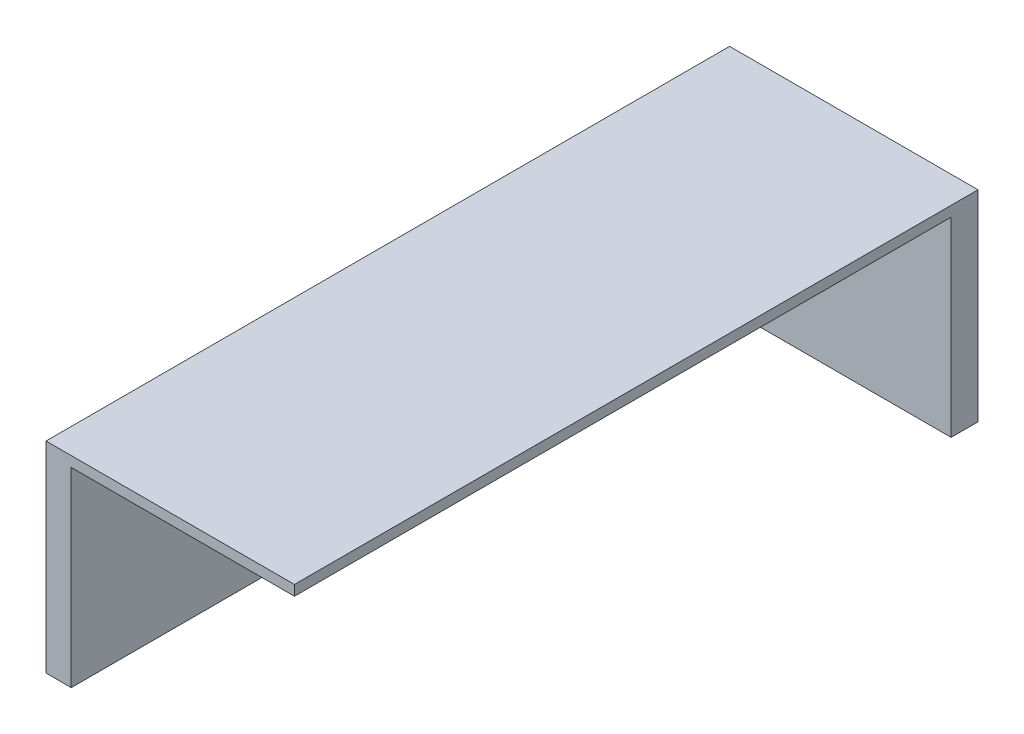
ISO-10303-21;
HEADER;
FILE_DESCRIPTION(('STEP AP214'),'2;1');
FILE_NAME('part.step','',(''),(''),'','','');
FILE_SCHEMA(('AUTOMOTIVE_DESIGN { 1 0 10303 214 1 1 1 1 }'));
ENDSEC;
DATA;
#1=APPLICATION_CONTEXT('core data for automotive mechanical design processes');
#2=APPLICATION_PROTOCOL_DEFINITION('international standard','automotive_design',2000,#1);
#3=PRODUCT_CONTEXT('',#1,'mechanical');
#4=PRODUCT('Part','Part','',(#3));
#5=PRODUCT_RELATED_PRODUCT_CATEGORY('part','',(#4));
#6=PRODUCT_DEFINITION_FORMATION('','',#4);
#7=PRODUCT_DEFINITION_CONTEXT('part definition',#1,'design');
#8=PRODUCT_DEFINITION('design','',#6,#7);
#9=PRODUCT_DEFINITION_SHAPE('','',#8);
#10=(LENGTH_UNIT() NAMED_UNIT(*) SI_UNIT(.MILLI.,.METRE.));
#11=(NAMED_UNIT(*) PLANE_ANGLE_UNIT() SI_UNIT($,.RADIAN.));
#12=(NAMED_UNIT(*) SI_UNIT($,.STERADIAN.) SOLID_ANGLE_UNIT());
#13=UNCERTAINTY_MEASURE_WITH_UNIT(LENGTH_MEASURE(1.E-05),#10,'distance_accuracy_value','');
#14=(GEOMETRIC_REPRESENTATION_CONTEXT(3) GLOBAL_UNCERTAINTY_ASSIGNED_CONTEXT((#13)) GLOBAL_UNIT_ASSIGNED_CONTEXT((#10,
#11,#12)) REPRESENTATION_CONTEXT('',''));
#15=CARTESIAN_POINT('',(0.,0.,0.));
#16=DIRECTION('',(0.,0.,1.));
#17=DIRECTION('',(1.,0.,0.));
#18=AXIS2_PLACEMENT_3D('',#15,#16,#17);
#19=CARTESIAN_POINT('',(0.,0.,0.));
#20=DIRECTION('',(0.,-1.,0.));
#21=DIRECTION('',(0.,0.,-1.));
#22=AXIS2_PLACEMENT_3D('',#19,#20,#21);
#23=PLANE('',#22);
#24=DIRECTION('',(1.,0.,0.));
#25=VECTOR('',#24,1.);
#26=CARTESIAN_POINT('',(0.,0.,17.8586237996086));
#27=LINE('',#26,#25);
#28=CARTESIAN_POINT('',(-111.341546011374,0.,17.8586237996086));
#29=VERTEX_POINT('',#28);
#30=CARTESIAN_POINT('',(-38.6584539886258,0.,17.8586237996086));
#31=VERTEX_POINT('',#30);
#32=EDGE_CURVE('E103',#29,#31,#27,.T.);
#33=ORIENTED_EDGE('',*,*,#32,.T.);
#34=DIRECTION('',(0.,0.,-1.));
#35=VECTOR('',#34,1.);
#36=CARTESIAN_POINT('',(-38.6584539886258,0.,0.));
#37=LINE('',#36,#35);
#38=CARTESIAN_POINT('',(-38.6584539886258,0.,-182.141376200391));
#39=VERTEX_POINT('',#38);
#40=EDGE_CURVE('E146',#31,#39,#37,.T.);
#41=ORIENTED_EDGE('',*,*,#40,.T.);
#42=DIRECTION('',(1.,0.,0.));
#43=VECTOR('',#42,1.);
#44=CARTESIAN_POINT('',(-111.341546011374,0.,-182.141376200391));
#45=LINE('',#44,#43);
#46=CARTESIAN_POINT('',(-111.341546011374,0.,-182.141376200391));
#47=VERTEX_POINT('',#46);
#48=EDGE_CURVE('E122',#47,#39,#45,.T.);
#49=ORIENTED_EDGE('',*,*,#48,.F.);
#50=DIRECTION('',(0.,0.,-1.));
#51=VECTOR('',#50,1.);
#52=CARTESIAN_POINT('',(-111.341546011374,0.,182.141376200391));
#53=LINE('',#52,#51);
#54=EDGE_CURVE('E128',#29,#47,#53,.T.);
#55=ORIENTED_EDGE('',*,*,#54,.F.);
#56=EDGE_LOOP('',(#33,#41,#49,#55));
#57=FACE_BOUND('',#56,.T.);
#58=ADVANCED_FACE('F39',(#57),#23,.F.);
#59=CARTESIAN_POINT('',(0.,-58.8,0.));
#60=DIRECTION('',(0.,-1.,0.));
#61=DIRECTION('',(0.,0.,-1.));
#62=AXIS2_PLACEMENT_3D('',#59,#60,#61);
#63=PLANE('',#62);
#64=DIRECTION('',(0.,0.,-1.));
#65=VECTOR('',#64,1.);
#66=CARTESIAN_POINT('',(-38.6584539886258,-58.8,17.8586237996086));
#67=LINE('',#66,#65);
#68=CARTESIAN_POINT('',(-38.6584539886258,-58.8,-174.272148859892));
#69=VERTEX_POINT('',#68);
#70=CARTESIAN_POINT('',(-38.6584539886258,-58.8,-182.141376200391));
#71=VERTEX_POINT('',#70);
#72=EDGE_CURVE('E108',#69,#71,#67,.T.);
#73=ORIENTED_EDGE('',*,*,#72,.F.);
#74=DIRECTION('',(1.,0.,0.));
#75=VECTOR('',#74,1.);
#76=CARTESIAN_POINT('',(-103.958701758156,-58.8,-174.272148859892));
#77=LINE('',#76,#75);
#78=CARTESIAN_POINT('',(-103.958701758156,-58.8,-174.272148859892));
#79=VERTEX_POINT('',#78);
#80=EDGE_CURVE('E162',#79,#69,#77,.T.);
#81=ORIENTED_EDGE('',*,*,#80,.F.);
#82=DIRECTION('',(0.,0.,-1.));
#83=VECTOR('',#82,1.);
#84=CARTESIAN_POINT('',(-103.958701758156,-58.8,174.272148859892));
#85=LINE('',#84,#83);
#86=CARTESIAN_POINT('',(-103.958701758156,-58.8,17.8586237996086));
#87=VERTEX_POINT('',#86);
#88=EDGE_CURVE('E114',#87,#79,#85,.T.);
#89=ORIENTED_EDGE('',*,*,#88,.F.);
#90=DIRECTION('',(1.,0.,0.));
#91=VECTOR('',#90,1.);
#92=CARTESIAN_POINT('',(-38.6584539886258,-58.8,17.8586237996086));
#93=LINE('',#92,#91);
#94=CARTESIAN_POINT('',(-111.341546011374,-58.8,17.8586237996086));
#95=VERTEX_POINT('',#94);
#96=EDGE_CURVE('E100',#95,#87,#93,.T.);
#97=ORIENTED_EDGE('',*,*,#96,.F.);
#98=DIRECTION('',(0.,0.,-1.));
#99=VECTOR('',#98,1.);
#100=CARTESIAN_POINT('',(-111.341546011374,-58.8,182.141376200391));
#101=LINE('',#100,#99);
#102=CARTESIAN_POINT('',(-111.341546011374,-58.8,-182.141376200391));
#103=VERTEX_POINT('',#102);
#104=EDGE_CURVE('E64',#95,#103,#101,.T.);
#105=ORIENTED_EDGE('',*,*,#104,.T.);
#106=DIRECTION('',(1.,0.,0.));
#107=VECTOR('',#106,1.);
#108=CARTESIAN_POINT('',(-111.341546011374,-58.8,-182.141376200391));
#109=LINE('',#108,#107);
#110=EDGE_CURVE('E121',#103,#71,#109,.T.);
#111=ORIENTED_EDGE('',*,*,#110,.T.);
#112=EDGE_LOOP('',(#73,#81,#89,#97,#105,#111));
#113=FACE_BOUND('',#112,.T.);
#114=ADVANCED_FACE('F112',(#113),#63,.T.);
#115=CARTESIAN_POINT('',(-111.341546011374,-58.8,-182.141376200391));
#116=DIRECTION('',(0.,0.,1.));
#117=DIRECTION('',(1.,0.,0.));
#118=AXIS2_PLACEMENT_3D('',#115,#116,#117);
#119=PLANE('',#118);
#120=ORIENTED_EDGE('',*,*,#48,.T.);
#121=DIRECTION('',(0.,-1.,0.));
#122=VECTOR('',#121,1.);
#123=CARTESIAN_POINT('',(-38.6584539886258,441.2,-182.141376200391));
#124=LINE('',#123,#122);
#125=EDGE_CURVE('E148',#39,#71,#124,.T.);
#126=ORIENTED_EDGE('',*,*,#125,.T.);
#127=ORIENTED_EDGE('',*,*,#110,.F.);
#128=DIRECTION('',(0.,1.,0.));
#129=VECTOR('',#128,1.);
#130=CARTESIAN_POINT('',(-111.341546011374,-58.8,-182.141376200391));
#131=LINE('',#130,#129);
#132=EDGE_CURVE('E118',#103,#47,#131,.T.);
#133=ORIENTED_EDGE('',*,*,#132,.T.);
#134=EDGE_LOOP('',(#120,#126,#127,#133));
#135=FACE_BOUND('',#134,.T.);
#136=ADVANCED_FACE('F186',(#135),#119,.F.);
#137=CARTESIAN_POINT('',(-111.341546011374,-58.8,182.141376200391));
#138=DIRECTION('',(1.,0.,0.));
#139=DIRECTION('',(0.,0.,-1.));
#140=AXIS2_PLACEMENT_3D('',#137,#138,#139);
#141=PLANE('',#140);
#142=ORIENTED_EDGE('',*,*,#104,.F.);
#143=DIRECTION('',(0.,-1.,0.));
#144=VECTOR('',#143,1.);
#145=CARTESIAN_POINT('',(-111.341546011374,441.2,17.8586237996086));
#146=LINE('',#145,#144);
#147=EDGE_CURVE('E98',#29,#95,#146,.T.);
#148=ORIENTED_EDGE('',*,*,#147,.F.);
#149=ORIENTED_EDGE('',*,*,#54,.T.);
#150=ORIENTED_EDGE('',*,*,#132,.F.);
#151=EDGE_LOOP('',(#142,#148,#149,#150));
#152=FACE_BOUND('',#151,.T.);
#153=ADVANCED_FACE('F41',(#152),#141,.F.);
#154=CARTESIAN_POINT('',(-103.958701758156,-3.,-174.272148859892));
#155=DIRECTION('',(0.,0.,-1.));
#156=DIRECTION('',(-1.,0.,0.));
#157=AXIS2_PLACEMENT_3D('',#154,#155,#156);
#158=PLANE('',#157);
#159=ORIENTED_EDGE('',*,*,#80,.T.);
#160=DIRECTION('',(0.,1.,0.));
#161=VECTOR('',#160,1.);
#162=CARTESIAN_POINT('',(-38.6584539886258,-3.,-174.272148859892));
#163=LINE('',#162,#161);
#164=CARTESIAN_POINT('',(-38.6584539886258,-3.,-174.272148859892));
#165=VERTEX_POINT('',#164);
#166=EDGE_CURVE('E170',#69,#165,#163,.T.);
#167=ORIENTED_EDGE('',*,*,#166,.T.);
#168=DIRECTION('',(1.,0.,0.));
#169=VECTOR('',#168,1.);
#170=CARTESIAN_POINT('',(-103.958701758156,-3.,-174.272148859892));
#171=LINE('',#170,#169);
#172=CARTESIAN_POINT('',(-103.958701758156,-3.,-174.272148859892));
#173=VERTEX_POINT('',#172);
#174=EDGE_CURVE('E153',#173,#165,#171,.T.);
#175=ORIENTED_EDGE('',*,*,#174,.F.);
#176=DIRECTION('',(0.,-1.,0.));
#177=VECTOR('',#176,1.);
#178=CARTESIAN_POINT('',(-103.958701758156,-3.,-174.272148859892));
#179=LINE('',#178,#177);
#180=EDGE_CURVE('E131',#173,#79,#179,.T.);
#181=ORIENTED_EDGE('',*,*,#180,.T.);
#182=EDGE_LOOP('',(#159,#167,#175,#181));
#183=FACE_BOUND('',#182,.T.);
#184=ADVANCED_FACE('F169',(#183),#158,.F.);
#185=CARTESIAN_POINT('',(-103.958701758156,-3.,174.272148859892));
#186=DIRECTION('',(-1.,0.,0.));
#187=DIRECTION('',(0.,0.,1.));
#188=AXIS2_PLACEMENT_3D('',#185,#186,#187);
#189=PLANE('',#188);
#190=DIRECTION('',(0.,0.,-1.));
#191=VECTOR('',#190,1.);
#192=CARTESIAN_POINT('',(-103.958701758156,-3.,174.272148859892));
#193=LINE('',#192,#191);
#194=CARTESIAN_POINT('',(-103.958701758156,-3.,17.8586237996086));
#195=VERTEX_POINT('',#194);
#196=EDGE_CURVE('E154',#195,#173,#193,.T.);
#197=ORIENTED_EDGE('',*,*,#196,.F.);
#198=DIRECTION('',(0.,-1.,0.));
#199=VECTOR('',#198,1.);
#200=CARTESIAN_POINT('',(-103.958701758156,-3.,17.8586237996086));
#201=LINE('',#200,#199);
#202=EDGE_CURVE('E55',#195,#87,#201,.T.);
#203=ORIENTED_EDGE('',*,*,#202,.T.);
#204=ORIENTED_EDGE('',*,*,#88,.T.);
#205=ORIENTED_EDGE('',*,*,#180,.F.);
#206=EDGE_LOOP('',(#197,#203,#204,#205));
#207=FACE_BOUND('',#206,.T.);
#208=ADVANCED_FACE('F198',(#207),#189,.F.);
#209=CARTESIAN_POINT('',(0.,-3.,0.));
#210=DIRECTION('',(0.,-1.,0.));
#211=DIRECTION('',(0.,0.,-1.));
#212=AXIS2_PLACEMENT_3D('',#209,#210,#211);
#213=PLANE('',#212);
#214=DIRECTION('',(0.,0.,-1.));
#215=VECTOR('',#214,1.);
#216=CARTESIAN_POINT('',(-38.6584539886258,-3.,0.));
#217=LINE('',#216,#215);
#218=CARTESIAN_POINT('',(-38.6584539886258,-3.,17.8586237996086));
#219=VERTEX_POINT('',#218);
#220=EDGE_CURVE('E11',#219,#165,#217,.T.);
#221=ORIENTED_EDGE('',*,*,#220,.F.);
#222=DIRECTION('',(1.,0.,0.));
#223=VECTOR('',#222,1.);
#224=CARTESIAN_POINT('',(0.,-3.,17.8586237996086));
#225=LINE('',#224,#223);
#226=EDGE_CURVE('E48',#195,#219,#225,.T.);
#227=ORIENTED_EDGE('',*,*,#226,.F.);
#228=ORIENTED_EDGE('',*,*,#196,.T.);
#229=ORIENTED_EDGE('',*,*,#174,.T.);
#230=EDGE_LOOP('',(#221,#227,#228,#229));
#231=FACE_BOUND('',#230,.T.);
#232=ADVANCED_FACE('F151',(#231),#213,.T.);
#233=CARTESIAN_POINT('',(-38.6584539886258,441.2,17.8586237996086));
#234=DIRECTION('',(-1.,0.,0.));
#235=DIRECTION('',(0.,0.,1.));
#236=AXIS2_PLACEMENT_3D('',#233,#234,#235);
#237=PLANE('',#236);
#238=DIRECTION('',(0.,-1.,0.));
#239=VECTOR('',#238,1.);
#240=CARTESIAN_POINT('',(-38.6584539886258,441.2,17.8586237996086));
#241=LINE('',#240,#239);
#242=EDGE_CURVE('E107',#31,#219,#241,.T.);
#243=ORIENTED_EDGE('',*,*,#242,.T.);
#244=ORIENTED_EDGE('',*,*,#220,.T.);
#245=ORIENTED_EDGE('',*,*,#166,.F.);
#246=ORIENTED_EDGE('',*,*,#72,.T.);
#247=ORIENTED_EDGE('',*,*,#125,.F.);
#248=ORIENTED_EDGE('',*,*,#40,.F.);
#249=EDGE_LOOP('',(#243,#244,#245,#246,#247,#248));
#250=FACE_BOUND('',#249,.T.);
#251=ADVANCED_FACE('F143',(#250),#237,.F.);
#252=CARTESIAN_POINT('',(-38.6584539886258,441.2,17.8586237996086));
#253=DIRECTION('',(0.,0.,-1.));
#254=DIRECTION('',(-1.,0.,0.));
#255=AXIS2_PLACEMENT_3D('',#252,#253,#254);
#256=PLANE('',#255);
#257=ORIENTED_EDGE('',*,*,#147,.T.);
#258=ORIENTED_EDGE('',*,*,#96,.T.);
#259=ORIENTED_EDGE('',*,*,#202,.F.);
#260=ORIENTED_EDGE('',*,*,#226,.T.);
#261=ORIENTED_EDGE('',*,*,#242,.F.);
#262=ORIENTED_EDGE('',*,*,#32,.F.);
#263=EDGE_LOOP('',(#257,#258,#259,#260,#261,#262));
#264=FACE_BOUND('',#263,.T.);
#265=ADVANCED_FACE('F99',(#264),#256,.F.);
#266=CLOSED_SHELL('',(#58,#114,#136,#153,#184,#208,#232,#251,#265));
#267=MANIFOLD_SOLID_BREP('B2',#266);
#268=ADVANCED_BREP_SHAPE_REPRESENTATION('',(#18,#267),#14);
#269=SHAPE_DEFINITION_REPRESENTATION(#9,#268);
ENDSEC;
END-ISO-10303-21;
